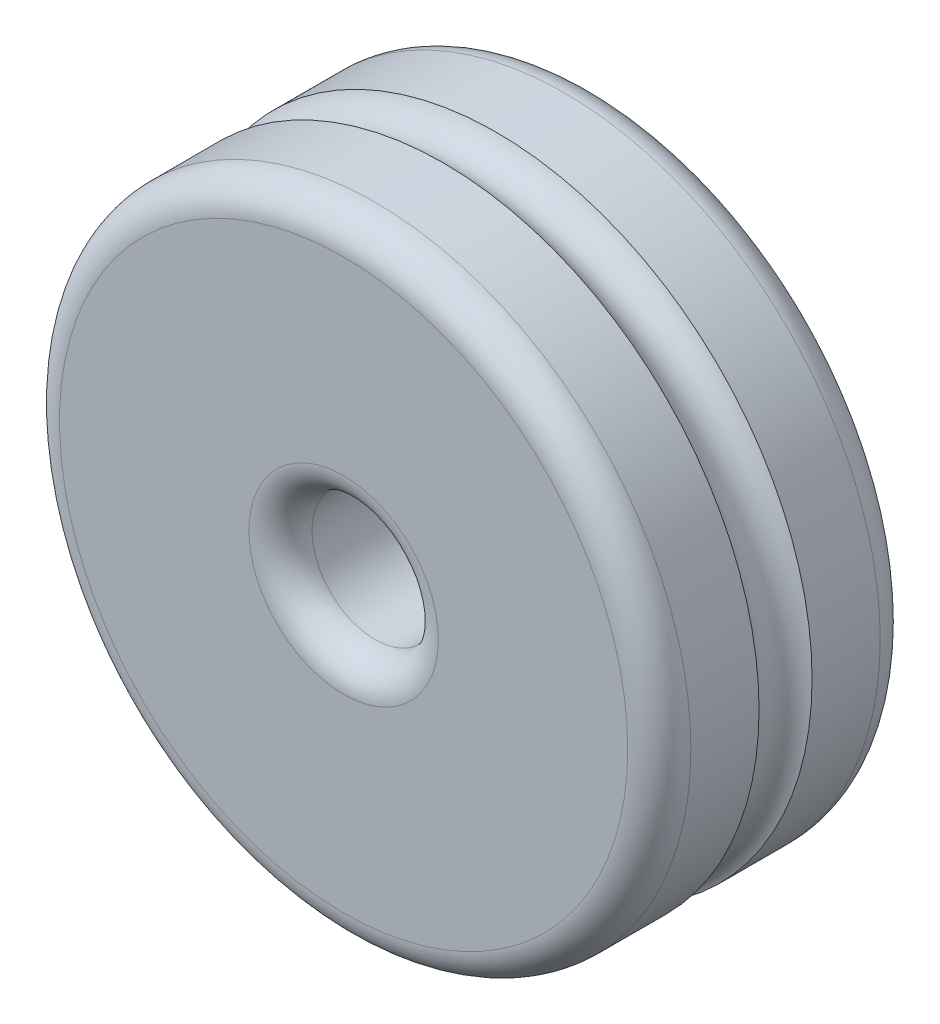
ISO-10303-21;
HEADER;
FILE_DESCRIPTION(('STEP AP214'),'2;1');
FILE_NAME('part.step','',(''),(''),'','','');
FILE_SCHEMA(('AUTOMOTIVE_DESIGN { 1 0 10303 214 1 1 1 1 }'));
ENDSEC;
DATA;
#1=APPLICATION_CONTEXT('core data for automotive mechanical design processes');
#2=APPLICATION_PROTOCOL_DEFINITION('international standard','automotive_design',2000,#1);
#3=PRODUCT_CONTEXT('',#1,'mechanical');
#4=PRODUCT('Part','Part','',(#3));
#5=PRODUCT_RELATED_PRODUCT_CATEGORY('part','',(#4));
#6=PRODUCT_DEFINITION_FORMATION('','',#4);
#7=PRODUCT_DEFINITION_CONTEXT('part definition',#1,'design');
#8=PRODUCT_DEFINITION('design','',#6,#7);
#9=PRODUCT_DEFINITION_SHAPE('','',#8);
#10=(LENGTH_UNIT() NAMED_UNIT(*) SI_UNIT(.MILLI.,.METRE.));
#11=(NAMED_UNIT(*) PLANE_ANGLE_UNIT() SI_UNIT($,.RADIAN.));
#12=(NAMED_UNIT(*) SI_UNIT($,.STERADIAN.) SOLID_ANGLE_UNIT());
#13=UNCERTAINTY_MEASURE_WITH_UNIT(LENGTH_MEASURE(1.E-05),#10,'distance_accuracy_value','');
#14=(GEOMETRIC_REPRESENTATION_CONTEXT(3) GLOBAL_UNCERTAINTY_ASSIGNED_CONTEXT((#13)) GLOBAL_UNIT_ASSIGNED_CONTEXT((#10,
#11,#12)) REPRESENTATION_CONTEXT('',''));
#15=CARTESIAN_POINT('',(0.,0.,0.));
#16=DIRECTION('',(0.,0.,1.));
#17=DIRECTION('',(1.,0.,0.));
#18=AXIS2_PLACEMENT_3D('',#15,#16,#17);
#19=CARTESIAN_POINT('',(0.,0.,-20.));
#20=DIRECTION('',(0.,0.,1.));
#21=DIRECTION('',(1.,0.,0.));
#22=AXIS2_PLACEMENT_3D('',#19,#20,#21);
#23=CYLINDRICAL_SURFACE('',#22,50.);
#24=CARTESIAN_POINT('',(0.,0.,-4.20054498472185));
#25=DIRECTION('',(0.,0.,1.));
#26=DIRECTION('',(1.,0.,0.));
#27=AXIS2_PLACEMENT_3D('',#24,#25,#26);
#28=CIRCLE('',#27,50.);
#29=CARTESIAN_POINT('',(50.,0.,-4.20054498472185));
#30=VERTEX_POINT('',#29);
#31=EDGE_CURVE('E35',#30,#30,#28,.T.);
#32=ORIENTED_EDGE('',*,*,#31,.F.);
#33=EDGE_LOOP('',(#32));
#34=FACE_BOUND('',#33,.T.);
#35=CARTESIAN_POINT('',(0.,0.,-15.));
#36=DIRECTION('',(0.,0.,1.));
#37=DIRECTION('',(1.,0.,0.));
#38=AXIS2_PLACEMENT_3D('',#35,#36,#37);
#39=CIRCLE('',#38,50.);
#40=CARTESIAN_POINT('',(50.,0.,-15.));
#41=VERTEX_POINT('',#40);
#42=EDGE_CURVE('E39',#41,#41,#39,.T.);
#43=ORIENTED_EDGE('',*,*,#42,.T.);
#44=EDGE_LOOP('',(#43));
#45=FACE_BOUND('',#44,.T.);
#46=ADVANCED_FACE('F31',(#34,#45),#23,.T.);
#47=CARTESIAN_POINT('',(0.,0.,4.20054498472185));
#48=DIRECTION('',(0.,0.,-1.));
#49=DIRECTION('',(-1.,0.,0.));
#50=AXIS2_PLACEMENT_3D('',#47,#48,#49);
#51=CIRCLE('',#50,50.);
#52=CARTESIAN_POINT('',(-50.,0.,4.20054498472185));
#53=VERTEX_POINT('',#52);
#54=EDGE_CURVE('E47',#53,#53,#51,.T.);
#55=ORIENTED_EDGE('',*,*,#54,.F.);
#56=EDGE_LOOP('',(#55));
#57=FACE_BOUND('',#56,.T.);
#58=CARTESIAN_POINT('',(0.,0.,15.));
#59=DIRECTION('',(0.,0.,1.));
#60=DIRECTION('',(1.,0.,0.));
#61=AXIS2_PLACEMENT_3D('',#58,#59,#60);
#62=CIRCLE('',#61,50.);
#63=CARTESIAN_POINT('',(50.,0.,15.));
#64=VERTEX_POINT('',#63);
#65=EDGE_CURVE('E10',#64,#64,#62,.F.);
#66=ORIENTED_EDGE('',*,*,#65,.T.);
#67=EDGE_LOOP('',(#66));
#68=FACE_BOUND('',#67,.T.);
#69=ADVANCED_FACE('F95',(#57,#68),#23,.T.);
#70=CARTESIAN_POINT('',(0.,0.,-20.));
#71=DIRECTION('',(0.,0.,1.));
#72=DIRECTION('',(1.,0.,0.));
#73=AXIS2_PLACEMENT_3D('',#70,#71,#72);
#74=PLANE('',#73);
#75=CARTESIAN_POINT('',(0.,0.,-20.));
#76=DIRECTION('',(0.,0.,1.));
#77=DIRECTION('',(1.,0.,0.));
#78=AXIS2_PLACEMENT_3D('',#75,#76,#77);
#79=CIRCLE('',#78,15.);
#80=CARTESIAN_POINT('',(15.,0.,-20.));
#81=VERTEX_POINT('',#80);
#82=EDGE_CURVE('E56',#81,#81,#79,.T.);
#83=ORIENTED_EDGE('',*,*,#82,.T.);
#84=EDGE_LOOP('',(#83));
#85=FACE_BOUND('',#84,.T.);
#86=CARTESIAN_POINT('',(0.,0.,-20.));
#87=DIRECTION('',(0.,0.,1.));
#88=DIRECTION('',(1.,0.,0.));
#89=AXIS2_PLACEMENT_3D('',#86,#87,#88);
#90=CIRCLE('',#89,45.);
#91=CARTESIAN_POINT('',(45.,0.,-20.));
#92=VERTEX_POINT('',#91);
#93=EDGE_CURVE('E52',#92,#92,#90,.F.);
#94=ORIENTED_EDGE('',*,*,#93,.T.);
#95=EDGE_LOOP('',(#94));
#96=FACE_BOUND('',#95,.T.);
#97=ADVANCED_FACE('F87',(#85,#96),#74,.F.);
#98=CARTESIAN_POINT('',(0.,0.,-20.));
#99=DIRECTION('',(0.,0.,1.));
#100=DIRECTION('',(1.,0.,0.));
#101=AXIS2_PLACEMENT_3D('',#98,#99,#100);
#102=CYLINDRICAL_SURFACE('',#101,10.);
#103=CARTESIAN_POINT('',(0.,0.,-15.));
#104=DIRECTION('',(0.,0.,1.));
#105=DIRECTION('',(1.,0.,0.));
#106=AXIS2_PLACEMENT_3D('',#103,#104,#105);
#107=CIRCLE('',#106,10.);
#108=CARTESIAN_POINT('',(10.,0.,-15.));
#109=VERTEX_POINT('',#108);
#110=EDGE_CURVE('E66',#109,#109,#107,.F.);
#111=ORIENTED_EDGE('',*,*,#110,.T.);
#112=EDGE_LOOP('',(#111));
#113=FACE_BOUND('',#112,.T.);
#114=CARTESIAN_POINT('',(0.,0.,15.));
#115=DIRECTION('',(0.,0.,1.));
#116=DIRECTION('',(1.,0.,0.));
#117=AXIS2_PLACEMENT_3D('',#114,#115,#116);
#118=CIRCLE('',#117,10.);
#119=CARTESIAN_POINT('',(10.,0.,15.));
#120=VERTEX_POINT('',#119);
#121=EDGE_CURVE('E61',#120,#120,#118,.T.);
#122=ORIENTED_EDGE('',*,*,#121,.T.);
#123=EDGE_LOOP('',(#122));
#124=FACE_BOUND('',#123,.T.);
#125=ADVANCED_FACE('F85',(#113,#124),#102,.F.);
#126=CARTESIAN_POINT('',(0.,0.,20.));
#127=DIRECTION('',(0.,0.,1.));
#128=DIRECTION('',(1.,0.,0.));
#129=AXIS2_PLACEMENT_3D('',#126,#127,#128);
#130=PLANE('',#129);
#131=CARTESIAN_POINT('',(0.,0.,20.));
#132=DIRECTION('',(0.,0.,1.));
#133=DIRECTION('',(1.,0.,0.));
#134=AXIS2_PLACEMENT_3D('',#131,#132,#133);
#135=CIRCLE('',#134,15.);
#136=CARTESIAN_POINT('',(15.,0.,20.));
#137=VERTEX_POINT('',#136);
#138=EDGE_CURVE('E44',#137,#137,#135,.F.);
#139=ORIENTED_EDGE('',*,*,#138,.T.);
#140=EDGE_LOOP('',(#139));
#141=FACE_BOUND('',#140,.T.);
#142=CARTESIAN_POINT('',(0.,0.,20.));
#143=DIRECTION('',(0.,0.,1.));
#144=DIRECTION('',(1.,0.,0.));
#145=AXIS2_PLACEMENT_3D('',#142,#143,#144);
#146=CIRCLE('',#145,45.);
#147=CARTESIAN_POINT('',(45.,0.,20.));
#148=VERTEX_POINT('',#147);
#149=EDGE_CURVE('E69',#148,#148,#146,.T.);
#150=ORIENTED_EDGE('',*,*,#149,.T.);
#151=EDGE_LOOP('',(#150));
#152=FACE_BOUND('',#151,.T.);
#153=ADVANCED_FACE('F74',(#141,#152),#130,.T.);
#154=CARTESIAN_POINT('',(0.,0.,-15.));
#155=DIRECTION('',(0.,0.,1.));
#156=DIRECTION('',(1.,0.,0.));
#157=AXIS2_PLACEMENT_3D('',#154,#155,#156);
#158=TOROIDAL_SURFACE('',#157,15.,5.);
#159=ORIENTED_EDGE('',*,*,#110,.F.);
#160=EDGE_LOOP('',(#159));
#161=FACE_BOUND('',#160,.T.);
#162=ORIENTED_EDGE('',*,*,#82,.F.);
#163=EDGE_LOOP('',(#162));
#164=FACE_BOUND('',#163,.T.);
#165=ADVANCED_FACE('F81',(#161,#164),#158,.T.);
#166=CARTESIAN_POINT('',(0.,0.,15.));
#167=DIRECTION('',(0.,0.,1.));
#168=DIRECTION('',(1.,0.,0.));
#169=AXIS2_PLACEMENT_3D('',#166,#167,#168);
#170=TOROIDAL_SURFACE('',#169,15.,5.);
#171=ORIENTED_EDGE('',*,*,#138,.F.);
#172=EDGE_LOOP('',(#171));
#173=FACE_BOUND('',#172,.T.);
#174=ORIENTED_EDGE('',*,*,#121,.F.);
#175=EDGE_LOOP('',(#174));
#176=FACE_BOUND('',#175,.T.);
#177=ADVANCED_FACE('F77',(#173,#176),#170,.T.);
#178=CARTESIAN_POINT('',(0.,0.,15.));
#179=DIRECTION('',(0.,0.,1.));
#180=DIRECTION('',(1.,0.,0.));
#181=AXIS2_PLACEMENT_3D('',#178,#179,#180);
#182=TOROIDAL_SURFACE('',#181,45.,5.);
#183=ORIENTED_EDGE('',*,*,#65,.F.);
#184=EDGE_LOOP('',(#183));
#185=FACE_BOUND('',#184,.T.);
#186=ORIENTED_EDGE('',*,*,#149,.F.);
#187=EDGE_LOOP('',(#186));
#188=FACE_BOUND('',#187,.T.);
#189=ADVANCED_FACE('F80',(#185,#188),#182,.T.);
#190=CARTESIAN_POINT('',(0.,0.,-15.));
#191=DIRECTION('',(0.,0.,1.));
#192=DIRECTION('',(1.,0.,0.));
#193=AXIS2_PLACEMENT_3D('',#190,#191,#192);
#194=TOROIDAL_SURFACE('',#193,45.,5.);
#195=ORIENTED_EDGE('',*,*,#93,.F.);
#196=EDGE_LOOP('',(#195));
#197=FACE_BOUND('',#196,.T.);
#198=ORIENTED_EDGE('',*,*,#42,.F.);
#199=EDGE_LOOP('',(#198));
#200=FACE_BOUND('',#199,.T.);
#201=ADVANCED_FACE('F33',(#197,#200),#194,.T.);
#202=CARTESIAN_POINT('',(0.,0.,0.));
#203=DIRECTION('',(0.,0.,-1.));
#204=DIRECTION('',(-1.,0.,0.));
#205=AXIS2_PLACEMENT_3D('',#202,#203,#204);
#206=TOROIDAL_SURFACE('',#205,51.6715424688668,4.52091057132268);
#207=ORIENTED_EDGE('',*,*,#31,.T.);
#208=EDGE_LOOP('',(#207));
#209=FACE_BOUND('',#208,.T.);
#210=ORIENTED_EDGE('',*,*,#54,.T.);
#211=EDGE_LOOP('',(#210));
#212=FACE_BOUND('',#211,.T.);
#213=ADVANCED_FACE('F114',(#209,#212),#206,.F.);
#214=CLOSED_SHELL('',(#46,#69,#97,#125,#153,#165,#177,#189,#201,#213));
#215=MANIFOLD_SOLID_BREP('B2',#214);
#216=ADVANCED_BREP_SHAPE_REPRESENTATION('',(#18,#215),#14);
#217=SHAPE_DEFINITION_REPRESENTATION(#9,#216);
ENDSEC;
END-ISO-10303-21;
